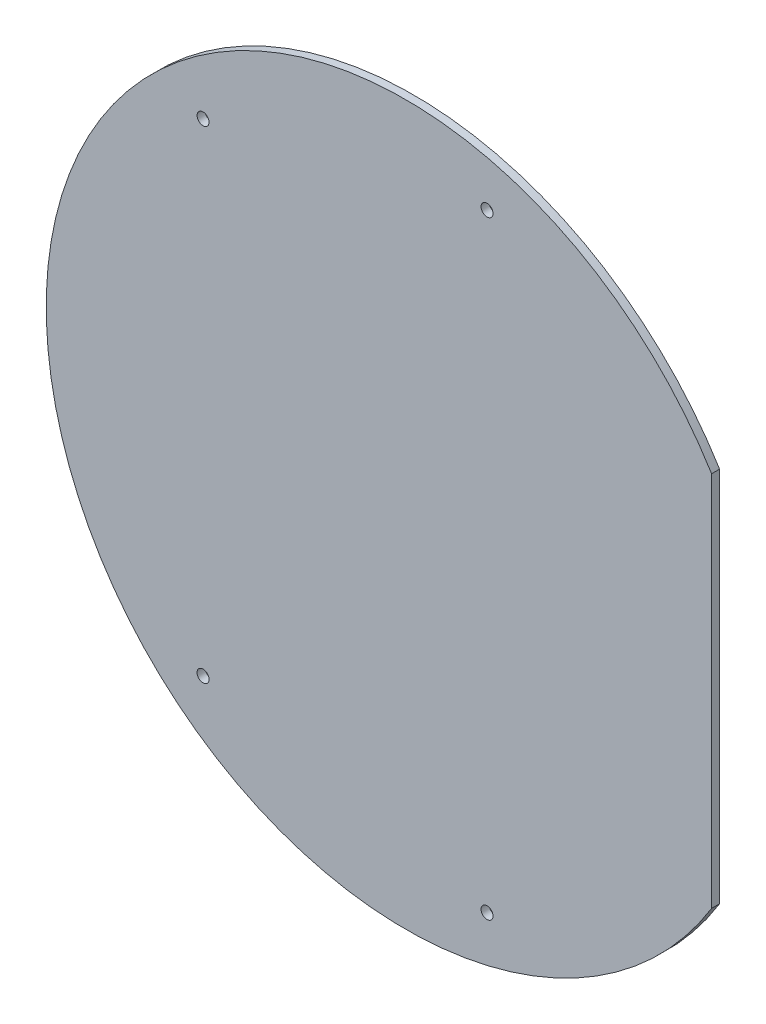
ISO-10303-21;
HEADER;
FILE_DESCRIPTION(('STEP AP214'),'2;1');
FILE_NAME('part.step','',(''),(''),'','','');
FILE_SCHEMA(('AUTOMOTIVE_DESIGN { 1 0 10303 214 1 1 1 1 }'));
ENDSEC;
DATA;
#1=APPLICATION_CONTEXT('core data for automotive mechanical design processes');
#2=APPLICATION_PROTOCOL_DEFINITION('international standard','automotive_design',2000,#1);
#3=PRODUCT_CONTEXT('',#1,'mechanical');
#4=PRODUCT('Part','Part','',(#3));
#5=PRODUCT_RELATED_PRODUCT_CATEGORY('part','',(#4));
#6=PRODUCT_DEFINITION_FORMATION('','',#4);
#7=PRODUCT_DEFINITION_CONTEXT('part definition',#1,'design');
#8=PRODUCT_DEFINITION('design','',#6,#7);
#9=PRODUCT_DEFINITION_SHAPE('','',#8);
#10=(LENGTH_UNIT() NAMED_UNIT(*) SI_UNIT(.MILLI.,.METRE.));
#11=(NAMED_UNIT(*) PLANE_ANGLE_UNIT() SI_UNIT($,.RADIAN.));
#12=(NAMED_UNIT(*) SI_UNIT($,.STERADIAN.) SOLID_ANGLE_UNIT());
#13=UNCERTAINTY_MEASURE_WITH_UNIT(LENGTH_MEASURE(1.E-05),#10,'distance_accuracy_value','');
#14=(GEOMETRIC_REPRESENTATION_CONTEXT(3) GLOBAL_UNCERTAINTY_ASSIGNED_CONTEXT((#13)) GLOBAL_UNIT_ASSIGNED_CONTEXT((#10,
#11,#12)) REPRESENTATION_CONTEXT('',''));
#15=CARTESIAN_POINT('',(0.,0.,0.));
#16=DIRECTION('',(0.,0.,1.));
#17=DIRECTION('',(1.,0.,0.));
#18=AXIS2_PLACEMENT_3D('',#15,#16,#17);
#19=CARTESIAN_POINT('',(115.,-70.7106781186548,0.));
#20=DIRECTION('',(-1.,0.,0.));
#21=DIRECTION('',(0.,1.,0.));
#22=AXIS2_PLACEMENT_3D('',#19,#20,#21);
#23=PLANE('',#22);
#24=DIRECTION('',(0.,-1.,0.));
#25=VECTOR('',#24,1.);
#26=CARTESIAN_POINT('',(115.,-70.7106781186548,3.));
#27=LINE('',#26,#25);
#28=CARTESIAN_POINT('',(115.,70.7106781186548,3.));
#29=VERTEX_POINT('',#28);
#30=CARTESIAN_POINT('',(115.,-70.7106781186548,3.));
#31=VERTEX_POINT('',#30);
#32=EDGE_CURVE('E96',#29,#31,#27,.T.);
#33=ORIENTED_EDGE('',*,*,#32,.T.);
#34=DIRECTION('',(0.,0.,1.));
#35=VECTOR('',#34,1.);
#36=CARTESIAN_POINT('',(115.,-70.7106781186548,0.));
#37=LINE('',#36,#35);
#38=CARTESIAN_POINT('',(115.,-70.7106781186548,0.));
#39=VERTEX_POINT('',#38);
#40=EDGE_CURVE('E105',#39,#31,#37,.T.);
#41=ORIENTED_EDGE('',*,*,#40,.F.);
#42=DIRECTION('',(0.,-1.,0.));
#43=VECTOR('',#42,1.);
#44=CARTESIAN_POINT('',(115.,-70.7106781186548,0.));
#45=LINE('',#44,#43);
#46=CARTESIAN_POINT('',(115.,70.7106781186548,0.));
#47=VERTEX_POINT('',#46);
#48=EDGE_CURVE('E110',#47,#39,#45,.T.);
#49=ORIENTED_EDGE('',*,*,#48,.F.);
#50=DIRECTION('',(0.,0.,1.));
#51=VECTOR('',#50,1.);
#52=CARTESIAN_POINT('',(115.,70.7106781186548,0.));
#53=LINE('',#52,#51);
#54=EDGE_CURVE('E108',#47,#29,#53,.T.);
#55=ORIENTED_EDGE('',*,*,#54,.T.);
#56=EDGE_LOOP('',(#33,#41,#49,#55));
#57=FACE_BOUND('',#56,.T.);
#58=ADVANCED_FACE('F14',(#57),#23,.F.);
#59=CARTESIAN_POINT('',(-76.0694494261891,-90.6261822735256,3.));
#60=DIRECTION('',(0.,0.,1.));
#61=DIRECTION('',(1.,0.,0.));
#62=AXIS2_PLACEMENT_3D('',#59,#60,#61);
#63=CYLINDRICAL_SURFACE('',#62,2.25);
#64=CARTESIAN_POINT('',(-76.0694494261891,-90.6261822735256,0.));
#65=DIRECTION('',(0.,0.,1.));
#66=DIRECTION('',(1.,0.,0.));
#67=AXIS2_PLACEMENT_3D('',#64,#65,#66);
#68=CIRCLE('',#67,2.25);
#69=CARTESIAN_POINT('',(-73.8194494261891,-90.6261822735256,0.));
#70=VERTEX_POINT('',#69);
#71=EDGE_CURVE('E135',#70,#70,#68,.T.);
#72=ORIENTED_EDGE('',*,*,#71,.F.);
#73=EDGE_LOOP('',(#72));
#74=FACE_BOUND('',#73,.T.);
#75=CARTESIAN_POINT('',(-76.0694494261891,-90.6261822735256,3.));
#76=DIRECTION('',(0.,0.,1.));
#77=DIRECTION('',(1.,0.,0.));
#78=AXIS2_PLACEMENT_3D('',#75,#76,#77);
#79=CIRCLE('',#78,2.25);
#80=CARTESIAN_POINT('',(-73.8194494261891,-90.6261822735256,3.));
#81=VERTEX_POINT('',#80);
#82=EDGE_CURVE('E104',#81,#81,#79,.T.);
#83=ORIENTED_EDGE('',*,*,#82,.T.);
#84=EDGE_LOOP('',(#83));
#85=FACE_BOUND('',#84,.T.);
#86=ADVANCED_FACE('F160',(#74,#85),#63,.F.);
#87=CARTESIAN_POINT('',(30.6294366010833,-114.280755815719,3.));
#88=DIRECTION('',(0.,0.,1.));
#89=DIRECTION('',(1.,0.,0.));
#90=AXIS2_PLACEMENT_3D('',#87,#88,#89);
#91=CYLINDRICAL_SURFACE('',#90,2.25);
#92=CARTESIAN_POINT('',(30.6294366010833,-114.280755815719,0.));
#93=DIRECTION('',(0.,0.,1.));
#94=DIRECTION('',(1.,0.,0.));
#95=AXIS2_PLACEMENT_3D('',#92,#93,#94);
#96=CIRCLE('',#95,2.25);
#97=CARTESIAN_POINT('',(32.8794366010832,-114.280755815719,0.));
#98=VERTEX_POINT('',#97);
#99=EDGE_CURVE('E127',#98,#98,#96,.T.);
#100=ORIENTED_EDGE('',*,*,#99,.F.);
#101=EDGE_LOOP('',(#100));
#102=FACE_BOUND('',#101,.T.);
#103=CARTESIAN_POINT('',(30.6294366010833,-114.280755815719,3.));
#104=DIRECTION('',(0.,0.,1.));
#105=DIRECTION('',(1.,0.,0.));
#106=AXIS2_PLACEMENT_3D('',#103,#104,#105);
#107=CIRCLE('',#106,2.25);
#108=CARTESIAN_POINT('',(32.8794366010832,-114.280755815719,3.));
#109=VERTEX_POINT('',#108);
#110=EDGE_CURVE('E76',#109,#109,#107,.T.);
#111=ORIENTED_EDGE('',*,*,#110,.T.);
#112=EDGE_LOOP('',(#111));
#113=FACE_BOUND('',#112,.T.);
#114=ADVANCED_FACE('F165',(#102,#113),#91,.F.);
#115=CARTESIAN_POINT('',(30.6294366010833,114.310613316101,3.));
#116=DIRECTION('',(0.,0.,1.));
#117=DIRECTION('',(1.,0.,0.));
#118=AXIS2_PLACEMENT_3D('',#115,#116,#117);
#119=CYLINDRICAL_SURFACE('',#118,2.25);
#120=CARTESIAN_POINT('',(30.6294366010833,114.310613316101,0.));
#121=DIRECTION('',(0.,0.,1.));
#122=DIRECTION('',(1.,0.,0.));
#123=AXIS2_PLACEMENT_3D('',#120,#121,#122);
#124=CIRCLE('',#123,2.25);
#125=CARTESIAN_POINT('',(32.8794366010832,114.310613316101,0.));
#126=VERTEX_POINT('',#125);
#127=EDGE_CURVE('E23',#126,#126,#124,.T.);
#128=ORIENTED_EDGE('',*,*,#127,.F.);
#129=EDGE_LOOP('',(#128));
#130=FACE_BOUND('',#129,.T.);
#131=CARTESIAN_POINT('',(30.6294366010833,114.310613316101,3.));
#132=DIRECTION('',(0.,0.,1.));
#133=DIRECTION('',(1.,0.,0.));
#134=AXIS2_PLACEMENT_3D('',#131,#132,#133);
#135=CIRCLE('',#134,2.25);
#136=CARTESIAN_POINT('',(32.8794366010832,114.310613316101,3.));
#137=VERTEX_POINT('',#136);
#138=EDGE_CURVE('E66',#137,#137,#135,.T.);
#139=ORIENTED_EDGE('',*,*,#138,.T.);
#140=EDGE_LOOP('',(#139));
#141=FACE_BOUND('',#140,.T.);
#142=ADVANCED_FACE('F156',(#130,#141),#119,.F.);
#143=CARTESIAN_POINT('',(-76.0694494261891,90.6560397739075,3.));
#144=DIRECTION('',(0.,0.,1.));
#145=DIRECTION('',(1.,0.,0.));
#146=AXIS2_PLACEMENT_3D('',#143,#144,#145);
#147=CYLINDRICAL_SURFACE('',#146,2.25);
#148=CARTESIAN_POINT('',(-76.0694494261891,90.6560397739075,0.));
#149=DIRECTION('',(0.,0.,1.));
#150=DIRECTION('',(1.,0.,0.));
#151=AXIS2_PLACEMENT_3D('',#148,#149,#150);
#152=CIRCLE('',#151,2.25);
#153=CARTESIAN_POINT('',(-73.8194494261891,90.6560397739075,0.));
#154=VERTEX_POINT('',#153);
#155=EDGE_CURVE('E9',#154,#154,#152,.T.);
#156=ORIENTED_EDGE('',*,*,#155,.F.);
#157=EDGE_LOOP('',(#156));
#158=FACE_BOUND('',#157,.T.);
#159=CARTESIAN_POINT('',(-76.0694494261891,90.6560397739075,3.));
#160=DIRECTION('',(0.,0.,1.));
#161=DIRECTION('',(1.,0.,0.));
#162=AXIS2_PLACEMENT_3D('',#159,#160,#161);
#163=CIRCLE('',#162,2.25);
#164=CARTESIAN_POINT('',(-73.8194494261891,90.6560397739075,3.));
#165=VERTEX_POINT('',#164);
#166=EDGE_CURVE('E55',#165,#165,#163,.T.);
#167=ORIENTED_EDGE('',*,*,#166,.T.);
#168=EDGE_LOOP('',(#167));
#169=FACE_BOUND('',#168,.T.);
#170=ADVANCED_FACE('F148',(#158,#169),#147,.F.);
#171=CARTESIAN_POINT('',(0.,0.,0.));
#172=DIRECTION('',(0.,0.,1.));
#173=DIRECTION('',(1.,0.,0.));
#174=AXIS2_PLACEMENT_3D('',#171,#172,#173);
#175=PLANE('',#174);
#176=ORIENTED_EDGE('',*,*,#155,.T.);
#177=EDGE_LOOP('',(#176));
#178=FACE_BOUND('',#177,.T.);
#179=ORIENTED_EDGE('',*,*,#127,.T.);
#180=EDGE_LOOP('',(#179));
#181=FACE_BOUND('',#180,.T.);
#182=ORIENTED_EDGE('',*,*,#99,.T.);
#183=EDGE_LOOP('',(#182));
#184=FACE_BOUND('',#183,.T.);
#185=ORIENTED_EDGE('',*,*,#71,.T.);
#186=EDGE_LOOP('',(#185));
#187=FACE_BOUND('',#186,.T.);
#188=CARTESIAN_POINT('',(0.,0.,0.));
#189=DIRECTION('',(0.,0.,1.));
#190=DIRECTION('',(1.,0.,0.));
#191=AXIS2_PLACEMENT_3D('',#188,#189,#190);
#192=CIRCLE('',#191,135.);
#193=EDGE_CURVE('E115',#47,#39,#192,.T.);
#194=ORIENTED_EDGE('',*,*,#193,.F.);
#195=ORIENTED_EDGE('',*,*,#48,.T.);
#196=EDGE_LOOP('',(#194,#195));
#197=FACE_BOUND('',#196,.T.);
#198=ADVANCED_FACE('F146',(#178,#181,#184,#187,#197),#175,.F.);
#199=CARTESIAN_POINT('',(0.,0.,3.));
#200=DIRECTION('',(0.,0.,1.));
#201=DIRECTION('',(1.,0.,0.));
#202=AXIS2_PLACEMENT_3D('',#199,#200,#201);
#203=PLANE('',#202);
#204=ORIENTED_EDGE('',*,*,#166,.F.);
#205=EDGE_LOOP('',(#204));
#206=FACE_BOUND('',#205,.T.);
#207=ORIENTED_EDGE('',*,*,#138,.F.);
#208=EDGE_LOOP('',(#207));
#209=FACE_BOUND('',#208,.T.);
#210=ORIENTED_EDGE('',*,*,#110,.F.);
#211=EDGE_LOOP('',(#210));
#212=FACE_BOUND('',#211,.T.);
#213=ORIENTED_EDGE('',*,*,#82,.F.);
#214=EDGE_LOOP('',(#213));
#215=FACE_BOUND('',#214,.T.);
#216=ORIENTED_EDGE('',*,*,#32,.F.);
#217=CARTESIAN_POINT('',(0.,0.,3.));
#218=DIRECTION('',(0.,0.,1.));
#219=DIRECTION('',(1.,0.,0.));
#220=AXIS2_PLACEMENT_3D('',#217,#218,#219);
#221=CIRCLE('',#220,135.);
#222=EDGE_CURVE('E99',#29,#31,#221,.T.);
#223=ORIENTED_EDGE('',*,*,#222,.T.);
#224=EDGE_LOOP('',(#216,#223));
#225=FACE_BOUND('',#224,.T.);
#226=ADVANCED_FACE('F16',(#206,#209,#212,#215,#225),#203,.T.);
#227=CARTESIAN_POINT('',(0.,0.,3.));
#228=DIRECTION('',(0.,0.,-1.));
#229=DIRECTION('',(-1.,0.,0.));
#230=AXIS2_PLACEMENT_3D('',#227,#228,#229);
#231=CYLINDRICAL_SURFACE('',#230,135.);
#232=ORIENTED_EDGE('',*,*,#222,.F.);
#233=ORIENTED_EDGE('',*,*,#54,.F.);
#234=ORIENTED_EDGE('',*,*,#193,.T.);
#235=ORIENTED_EDGE('',*,*,#40,.T.);
#236=EDGE_LOOP('',(#232,#233,#234,#235));
#237=FACE_BOUND('',#236,.T.);
#238=ADVANCED_FACE('F117',(#237),#231,.T.);
#239=CLOSED_SHELL('',(#58,#86,#114,#142,#170,#198,#226,#238));
#240=MANIFOLD_SOLID_BREP('B1',#239);
#241=ADVANCED_BREP_SHAPE_REPRESENTATION('',(#18,#240),#14);
#242=SHAPE_DEFINITION_REPRESENTATION(#9,#241);
ENDSEC;
END-ISO-10303-21;
